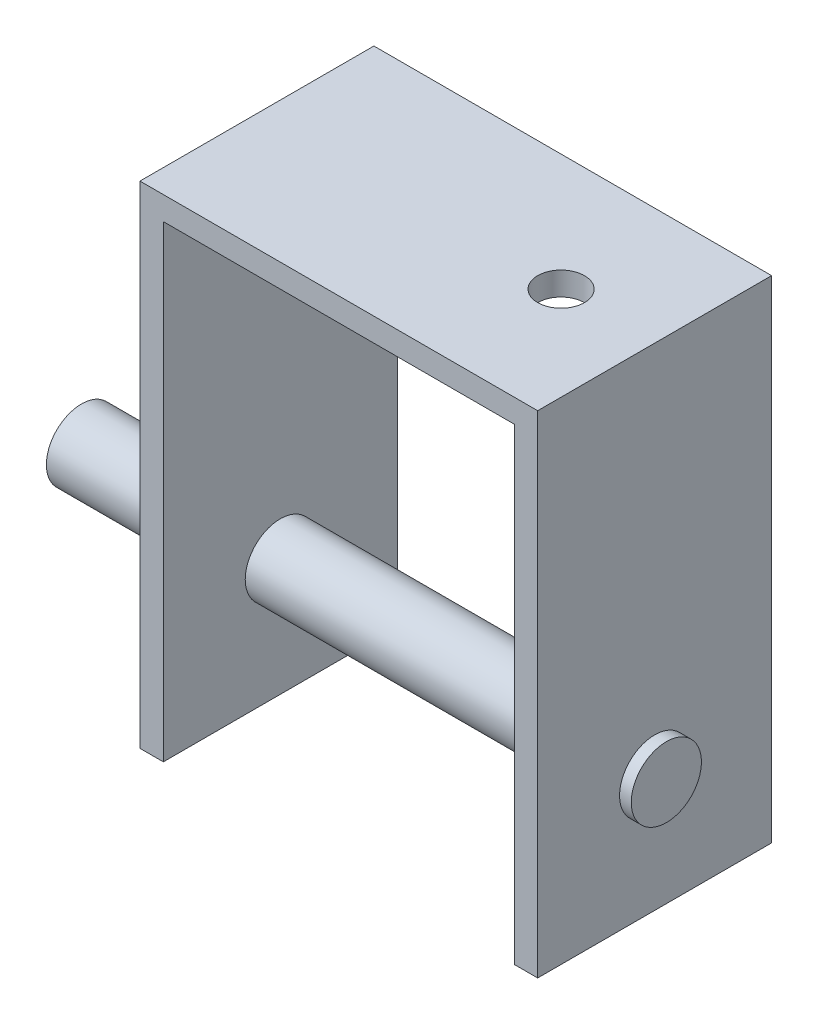
ISO-10303-21;
HEADER;
FILE_DESCRIPTION(('STEP AP214'),'2;1');
FILE_NAME('part.step','',(''),(''),'','','');
FILE_SCHEMA(('AUTOMOTIVE_DESIGN { 1 0 10303 214 1 1 1 1 }'));
ENDSEC;
DATA;
#1=APPLICATION_CONTEXT('core data for automotive mechanical design processes');
#2=APPLICATION_PROTOCOL_DEFINITION('international standard','automotive_design',2000,#1);
#3=PRODUCT_CONTEXT('',#1,'mechanical');
#4=PRODUCT('Part','Part','',(#3));
#5=PRODUCT_RELATED_PRODUCT_CATEGORY('part','',(#4));
#6=PRODUCT_DEFINITION_FORMATION('','',#4);
#7=PRODUCT_DEFINITION_CONTEXT('part definition',#1,'design');
#8=PRODUCT_DEFINITION('design','',#6,#7);
#9=PRODUCT_DEFINITION_SHAPE('','',#8);
#10=(LENGTH_UNIT() NAMED_UNIT(*) SI_UNIT(.MILLI.,.METRE.));
#11=(NAMED_UNIT(*) PLANE_ANGLE_UNIT() SI_UNIT($,.RADIAN.));
#12=(NAMED_UNIT(*) SI_UNIT($,.STERADIAN.) SOLID_ANGLE_UNIT());
#13=UNCERTAINTY_MEASURE_WITH_UNIT(LENGTH_MEASURE(1.E-05),#10,'distance_accuracy_value','');
#14=(GEOMETRIC_REPRESENTATION_CONTEXT(3) GLOBAL_UNCERTAINTY_ASSIGNED_CONTEXT((#13)) GLOBAL_UNIT_ASSIGNED_CONTEXT((#10,
#11,#12)) REPRESENTATION_CONTEXT('',''));
#15=CARTESIAN_POINT('',(0.,0.,0.));
#16=DIRECTION('',(0.,0.,1.));
#17=DIRECTION('',(1.,0.,0.));
#18=AXIS2_PLACEMENT_3D('',#15,#16,#17);
#19=CARTESIAN_POINT('',(-38.9636651003149,28.8453586159442,20.));
#20=DIRECTION('',(1.,0.,0.));
#21=DIRECTION('',(0.,1.,0.));
#22=AXIS2_PLACEMENT_3D('',#19,#20,#21);
#23=PLANE('',#22);
#24=CARTESIAN_POINT('',(-38.9636651003148,-1.15464138405578,10.));
#25=DIRECTION('',(1.,0.,0.));
#26=DIRECTION('',(0.,1.,0.));
#27=AXIS2_PLACEMENT_3D('',#24,#25,#26);
#28=CIRCLE('',#27,3.);
#29=CARTESIAN_POINT('',(-38.9636651003148,1.84535861594422,10.));
#30=VERTEX_POINT('',#29);
#31=EDGE_CURVE('E146',#30,#30,#28,.T.);
#32=ORIENTED_EDGE('',*,*,#31,.T.);
#33=EDGE_LOOP('',(#32));
#34=FACE_BOUND('',#33,.T.);
#35=DIRECTION('',(0.,-1.,0.));
#36=VECTOR('',#35,1.);
#37=CARTESIAN_POINT('',(-38.9636651003149,28.8453586159442,0.));
#38=LINE('',#37,#36);
#39=CARTESIAN_POINT('',(-38.9636651003149,30.8453586159442,0.));
#40=VERTEX_POINT('',#39);
#41=CARTESIAN_POINT('',(-38.9636651003148,-11.1546413840558,0.));
#42=VERTEX_POINT('',#41);
#43=EDGE_CURVE('E100',#40,#42,#38,.T.);
#44=ORIENTED_EDGE('',*,*,#43,.T.);
#45=DIRECTION('',(0.,0.,-1.));
#46=VECTOR('',#45,1.);
#47=CARTESIAN_POINT('',(-38.9636651003148,-11.1546413840558,20.));
#48=LINE('',#47,#46);
#49=CARTESIAN_POINT('',(-38.9636651003148,-11.1546413840558,20.));
#50=VERTEX_POINT('',#49);
#51=EDGE_CURVE('E13',#50,#42,#48,.T.);
#52=ORIENTED_EDGE('',*,*,#51,.F.);
#53=DIRECTION('',(0.,-1.,0.));
#54=VECTOR('',#53,1.);
#55=CARTESIAN_POINT('',(-38.9636651003149,30.8453586159442,20.));
#56=LINE('',#55,#54);
#57=CARTESIAN_POINT('',(-38.9636651003149,30.8453586159442,20.));
#58=VERTEX_POINT('',#57);
#59=EDGE_CURVE('E106',#58,#50,#56,.T.);
#60=ORIENTED_EDGE('',*,*,#59,.F.);
#61=DIRECTION('',(0.,0.,-1.));
#62=VECTOR('',#61,1.);
#63=CARTESIAN_POINT('',(-38.9636651003149,30.8453586159442,20.));
#64=LINE('',#63,#62);
#65=EDGE_CURVE('E140',#58,#40,#64,.T.);
#66=ORIENTED_EDGE('',*,*,#65,.T.);
#67=EDGE_LOOP('',(#44,#52,#60,#66));
#68=FACE_BOUND('',#67,.T.);
#69=ADVANCED_FACE('F47',(#34,#68),#23,.F.);
#70=CARTESIAN_POINT('',(-38.9636651003148,-11.1546413840558,20.));
#71=DIRECTION('',(0.,1.,0.));
#72=DIRECTION('',(0.,0.,1.));
#73=AXIS2_PLACEMENT_3D('',#70,#71,#72);
#74=PLANE('',#73);
#75=DIRECTION('',(1.,0.,0.));
#76=VECTOR('',#75,1.);
#77=CARTESIAN_POINT('',(-38.9636651003148,-11.1546413840558,0.));
#78=LINE('',#77,#76);
#79=CARTESIAN_POINT('',(-36.9636651003148,-11.1546413840558,0.));
#80=VERTEX_POINT('',#79);
#81=EDGE_CURVE('E145',#42,#80,#78,.T.);
#82=ORIENTED_EDGE('',*,*,#81,.T.);
#83=DIRECTION('',(0.,0.,-1.));
#84=VECTOR('',#83,1.);
#85=CARTESIAN_POINT('',(-36.9636651003148,-11.1546413840558,20.));
#86=LINE('',#85,#84);
#87=CARTESIAN_POINT('',(-36.9636651003148,-11.1546413840558,20.));
#88=VERTEX_POINT('',#87);
#89=EDGE_CURVE('E56',#88,#80,#86,.T.);
#90=ORIENTED_EDGE('',*,*,#89,.F.);
#91=DIRECTION('',(1.,0.,0.));
#92=VECTOR('',#91,1.);
#93=CARTESIAN_POINT('',(-38.9636651003148,-11.1546413840558,20.));
#94=LINE('',#93,#92);
#95=EDGE_CURVE('E191',#50,#88,#94,.T.);
#96=ORIENTED_EDGE('',*,*,#95,.F.);
#97=ORIENTED_EDGE('',*,*,#51,.T.);
#98=EDGE_LOOP('',(#82,#90,#96,#97));
#99=FACE_BOUND('',#98,.T.);
#100=ADVANCED_FACE('F228',(#99),#74,.F.);
#101=CARTESIAN_POINT('',(-36.9636651003148,-11.1546413840558,20.));
#102=DIRECTION('',(-1.,0.,0.));
#103=DIRECTION('',(0.,0.,1.));
#104=AXIS2_PLACEMENT_3D('',#101,#102,#103);
#105=PLANE('',#104);
#106=CARTESIAN_POINT('',(-36.9636651003148,-1.15464138405578,10.));
#107=DIRECTION('',(-1.,0.,0.));
#108=DIRECTION('',(0.,0.,1.));
#109=AXIS2_PLACEMENT_3D('',#106,#107,#108);
#110=CIRCLE('',#109,3.);
#111=CARTESIAN_POINT('',(-36.9636651003148,-1.15464138405578,13.));
#112=VERTEX_POINT('',#111);
#113=EDGE_CURVE('E196',#112,#112,#110,.T.);
#114=ORIENTED_EDGE('',*,*,#113,.T.);
#115=EDGE_LOOP('',(#114));
#116=FACE_BOUND('',#115,.T.);
#117=DIRECTION('',(0.,1.,0.));
#118=VECTOR('',#117,1.);
#119=CARTESIAN_POINT('',(-36.9636651003148,-11.1546413840558,0.));
#120=LINE('',#119,#118);
#121=CARTESIAN_POINT('',(-36.9636651003148,28.8453586159442,0.));
#122=VERTEX_POINT('',#121);
#123=EDGE_CURVE('E148',#80,#122,#120,.T.);
#124=ORIENTED_EDGE('',*,*,#123,.T.);
#125=DIRECTION('',(0.,0.,-1.));
#126=VECTOR('',#125,1.);
#127=CARTESIAN_POINT('',(-36.9636651003148,28.8453586159442,20.));
#128=LINE('',#127,#126);
#129=CARTESIAN_POINT('',(-36.9636651003148,28.8453586159442,20.));
#130=VERTEX_POINT('',#129);
#131=EDGE_CURVE('E165',#130,#122,#128,.T.);
#132=ORIENTED_EDGE('',*,*,#131,.F.);
#133=DIRECTION('',(0.,1.,0.));
#134=VECTOR('',#133,1.);
#135=CARTESIAN_POINT('',(-36.9636651003148,-11.1546413840558,20.));
#136=LINE('',#135,#134);
#137=EDGE_CURVE('E175',#88,#130,#136,.T.);
#138=ORIENTED_EDGE('',*,*,#137,.F.);
#139=ORIENTED_EDGE('',*,*,#89,.T.);
#140=EDGE_LOOP('',(#124,#132,#138,#139));
#141=FACE_BOUND('',#140,.T.);
#142=ADVANCED_FACE('F173',(#116,#141),#105,.F.);
#143=CARTESIAN_POINT('',(-36.9636651003148,28.8453586159442,20.));
#144=DIRECTION('',(0.,1.,0.));
#145=DIRECTION('',(0.,0.,1.));
#146=AXIS2_PLACEMENT_3D('',#143,#144,#145);
#147=PLANE('',#146);
#148=CARTESIAN_POINT('',(-12.9636651003149,28.8453586159442,10.));
#149=DIRECTION('',(0.,1.,0.));
#150=DIRECTION('',(0.,0.,1.));
#151=AXIS2_PLACEMENT_3D('',#148,#149,#150);
#152=CIRCLE('',#151,2.);
#153=CARTESIAN_POINT('',(-12.9636651003149,28.8453586159442,12.));
#154=VERTEX_POINT('',#153);
#155=EDGE_CURVE('E208',#154,#154,#152,.T.);
#156=ORIENTED_EDGE('',*,*,#155,.T.);
#157=EDGE_LOOP('',(#156));
#158=FACE_BOUND('',#157,.T.);
#159=DIRECTION('',(1.,0.,0.));
#160=VECTOR('',#159,1.);
#161=CARTESIAN_POINT('',(-36.9636651003148,28.8453586159442,0.));
#162=LINE('',#161,#160);
#163=CARTESIAN_POINT('',(-6.96366510031485,28.8453586159442,0.));
#164=VERTEX_POINT('',#163);
#165=EDGE_CURVE('E150',#122,#164,#162,.T.);
#166=ORIENTED_EDGE('',*,*,#165,.T.);
#167=DIRECTION('',(0.,0.,-1.));
#168=VECTOR('',#167,1.);
#169=CARTESIAN_POINT('',(-6.96366510031485,28.8453586159442,20.));
#170=LINE('',#169,#168);
#171=CARTESIAN_POINT('',(-6.96366510031485,28.8453586159442,20.));
#172=VERTEX_POINT('',#171);
#173=EDGE_CURVE('E162',#172,#164,#170,.T.);
#174=ORIENTED_EDGE('',*,*,#173,.F.);
#175=DIRECTION('',(1.,0.,0.));
#176=VECTOR('',#175,1.);
#177=CARTESIAN_POINT('',(-36.9636651003148,28.8453586159442,20.));
#178=LINE('',#177,#176);
#179=EDGE_CURVE('E187',#130,#172,#178,.T.);
#180=ORIENTED_EDGE('',*,*,#179,.F.);
#181=ORIENTED_EDGE('',*,*,#131,.T.);
#182=EDGE_LOOP('',(#166,#174,#180,#181));
#183=FACE_BOUND('',#182,.T.);
#184=ADVANCED_FACE('F183',(#158,#183),#147,.F.);
#185=CARTESIAN_POINT('',(-6.96366510031485,28.8453586159442,20.));
#186=DIRECTION('',(1.,0.,0.));
#187=DIRECTION('',(0.,1.,0.));
#188=AXIS2_PLACEMENT_3D('',#185,#186,#187);
#189=PLANE('',#188);
#190=CARTESIAN_POINT('',(-6.96366510031484,-1.15464138405578,10.));
#191=DIRECTION('',(1.,0.,0.));
#192=DIRECTION('',(0.,1.,0.));
#193=AXIS2_PLACEMENT_3D('',#190,#191,#192);
#194=CIRCLE('',#193,3.);
#195=CARTESIAN_POINT('',(-6.96366510031484,1.84535861594422,10.));
#196=VERTEX_POINT('',#195);
#197=EDGE_CURVE('E199',#196,#196,#194,.T.);
#198=ORIENTED_EDGE('',*,*,#197,.T.);
#199=EDGE_LOOP('',(#198));
#200=FACE_BOUND('',#199,.T.);
#201=DIRECTION('',(0.,-1.,0.));
#202=VECTOR('',#201,1.);
#203=CARTESIAN_POINT('',(-6.96366510031485,28.8453586159442,0.));
#204=LINE('',#203,#202);
#205=CARTESIAN_POINT('',(-6.96366510031484,-11.1546413840558,0.));
#206=VERTEX_POINT('',#205);
#207=EDGE_CURVE('E152',#164,#206,#204,.T.);
#208=ORIENTED_EDGE('',*,*,#207,.T.);
#209=DIRECTION('',(0.,0.,-1.));
#210=VECTOR('',#209,1.);
#211=CARTESIAN_POINT('',(-6.96366510031484,-11.1546413840558,20.));
#212=LINE('',#211,#210);
#213=CARTESIAN_POINT('',(-6.96366510031484,-11.1546413840558,20.));
#214=VERTEX_POINT('',#213);
#215=EDGE_CURVE('E135',#214,#206,#212,.T.);
#216=ORIENTED_EDGE('',*,*,#215,.F.);
#217=DIRECTION('',(0.,-1.,0.));
#218=VECTOR('',#217,1.);
#219=CARTESIAN_POINT('',(-6.96366510031485,28.8453586159442,20.));
#220=LINE('',#219,#218);
#221=EDGE_CURVE('E126',#172,#214,#220,.T.);
#222=ORIENTED_EDGE('',*,*,#221,.F.);
#223=ORIENTED_EDGE('',*,*,#173,.T.);
#224=EDGE_LOOP('',(#208,#216,#222,#223));
#225=FACE_BOUND('',#224,.T.);
#226=ADVANCED_FACE('F186',(#200,#225),#189,.F.);
#227=CARTESIAN_POINT('',(-6.96366510031484,-11.1546413840558,20.));
#228=DIRECTION('',(0.,1.,0.));
#229=DIRECTION('',(0.,0.,1.));
#230=AXIS2_PLACEMENT_3D('',#227,#228,#229);
#231=PLANE('',#230);
#232=DIRECTION('',(1.,0.,0.));
#233=VECTOR('',#232,1.);
#234=CARTESIAN_POINT('',(-6.96366510031484,-11.1546413840558,0.));
#235=LINE('',#234,#233);
#236=CARTESIAN_POINT('',(-4.96366510031484,-11.1546413840558,0.));
#237=VERTEX_POINT('',#236);
#238=EDGE_CURVE('E134',#206,#237,#235,.T.);
#239=ORIENTED_EDGE('',*,*,#238,.T.);
#240=DIRECTION('',(0.,0.,-1.));
#241=VECTOR('',#240,1.);
#242=CARTESIAN_POINT('',(-4.96366510031484,-11.1546413840558,20.));
#243=LINE('',#242,#241);
#244=CARTESIAN_POINT('',(-4.96366510031484,-11.1546413840558,20.));
#245=VERTEX_POINT('',#244);
#246=EDGE_CURVE('E131',#245,#237,#243,.T.);
#247=ORIENTED_EDGE('',*,*,#246,.F.);
#248=DIRECTION('',(1.,0.,0.));
#249=VECTOR('',#248,1.);
#250=CARTESIAN_POINT('',(-6.96366510031484,-11.1546413840558,20.));
#251=LINE('',#250,#249);
#252=EDGE_CURVE('E120',#214,#245,#251,.T.);
#253=ORIENTED_EDGE('',*,*,#252,.F.);
#254=ORIENTED_EDGE('',*,*,#215,.T.);
#255=EDGE_LOOP('',(#239,#247,#253,#254));
#256=FACE_BOUND('',#255,.T.);
#257=ADVANCED_FACE('F132',(#256),#231,.F.);
#258=CARTESIAN_POINT('',(-4.96366510031484,-11.1546413840558,20.));
#259=DIRECTION('',(-1.,0.,0.));
#260=DIRECTION('',(0.,-1.,0.));
#261=AXIS2_PLACEMENT_3D('',#258,#259,#260);
#262=PLANE('',#261);
#263=CARTESIAN_POINT('',(-4.96366510031484,-1.15464138405578,10.));
#264=DIRECTION('',(-1.,0.,0.));
#265=DIRECTION('',(0.,-1.,0.));
#266=AXIS2_PLACEMENT_3D('',#263,#264,#265);
#267=CIRCLE('',#266,3.);
#268=CARTESIAN_POINT('',(-4.96366510031484,-4.15464138405578,10.));
#269=VERTEX_POINT('',#268);
#270=EDGE_CURVE('E50',#269,#269,#267,.T.);
#271=ORIENTED_EDGE('',*,*,#270,.T.);
#272=EDGE_LOOP('',(#271));
#273=FACE_BOUND('',#272,.T.);
#274=DIRECTION('',(0.,1.,0.));
#275=VECTOR('',#274,1.);
#276=CARTESIAN_POINT('',(-4.96366510031484,-11.1546413840558,0.));
#277=LINE('',#276,#275);
#278=CARTESIAN_POINT('',(-4.96366510031484,30.8453586159442,0.));
#279=VERTEX_POINT('',#278);
#280=EDGE_CURVE('E93',#237,#279,#277,.T.);
#281=ORIENTED_EDGE('',*,*,#280,.T.);
#282=DIRECTION('',(0.,0.,-1.));
#283=VECTOR('',#282,1.);
#284=CARTESIAN_POINT('',(-4.96366510031484,30.8453586159442,20.));
#285=LINE('',#284,#283);
#286=CARTESIAN_POINT('',(-4.96366510031484,30.8453586159442,20.));
#287=VERTEX_POINT('',#286);
#288=EDGE_CURVE('E136',#287,#279,#285,.T.);
#289=ORIENTED_EDGE('',*,*,#288,.F.);
#290=DIRECTION('',(0.,1.,0.));
#291=VECTOR('',#290,1.);
#292=CARTESIAN_POINT('',(-4.96366510031484,-11.1546413840558,20.));
#293=LINE('',#292,#291);
#294=EDGE_CURVE('E124',#245,#287,#293,.T.);
#295=ORIENTED_EDGE('',*,*,#294,.F.);
#296=ORIENTED_EDGE('',*,*,#246,.T.);
#297=EDGE_LOOP('',(#281,#289,#295,#296));
#298=FACE_BOUND('',#297,.T.);
#299=ADVANCED_FACE('F138',(#273,#298),#262,.F.);
#300=CARTESIAN_POINT('',(-4.96366510031484,30.8453586159442,20.));
#301=DIRECTION('',(0.,-1.,0.));
#302=DIRECTION('',(1.,0.,0.));
#303=AXIS2_PLACEMENT_3D('',#300,#301,#302);
#304=PLANE('',#303);
#305=CARTESIAN_POINT('',(-12.9636651003149,30.8453586159442,10.));
#306=DIRECTION('',(0.,1.,0.));
#307=DIRECTION('',(0.,0.,1.));
#308=AXIS2_PLACEMENT_3D('',#305,#306,#307);
#309=CIRCLE('',#308,2.);
#310=CARTESIAN_POINT('',(-12.9636651003149,30.8453586159442,12.));
#311=VERTEX_POINT('',#310);
#312=EDGE_CURVE('E209',#311,#311,#309,.T.);
#313=ORIENTED_EDGE('',*,*,#312,.F.);
#314=EDGE_LOOP('',(#313));
#315=FACE_BOUND('',#314,.T.);
#316=DIRECTION('',(-1.,0.,0.));
#317=VECTOR('',#316,1.);
#318=CARTESIAN_POINT('',(-4.96366510031484,30.8453586159442,0.));
#319=LINE('',#318,#317);
#320=EDGE_CURVE('E156',#279,#40,#319,.T.);
#321=ORIENTED_EDGE('',*,*,#320,.T.);
#322=ORIENTED_EDGE('',*,*,#65,.F.);
#323=DIRECTION('',(-1.,0.,0.));
#324=VECTOR('',#323,1.);
#325=CARTESIAN_POINT('',(-4.96366510031484,30.8453586159442,20.));
#326=LINE('',#325,#324);
#327=EDGE_CURVE('E64',#287,#58,#326,.T.);
#328=ORIENTED_EDGE('',*,*,#327,.F.);
#329=ORIENTED_EDGE('',*,*,#288,.T.);
#330=EDGE_LOOP('',(#321,#322,#328,#329));
#331=FACE_BOUND('',#330,.T.);
#332=ADVANCED_FACE('F223',(#315,#331),#304,.F.);
#333=CARTESIAN_POINT('',(0.,0.,20.));
#334=DIRECTION('',(0.,0.,1.));
#335=DIRECTION('',(1.,0.,0.));
#336=AXIS2_PLACEMENT_3D('',#333,#334,#335);
#337=PLANE('',#336);
#338=ORIENTED_EDGE('',*,*,#59,.T.);
#339=ORIENTED_EDGE('',*,*,#95,.T.);
#340=ORIENTED_EDGE('',*,*,#137,.T.);
#341=ORIENTED_EDGE('',*,*,#179,.T.);
#342=ORIENTED_EDGE('',*,*,#221,.T.);
#343=ORIENTED_EDGE('',*,*,#252,.T.);
#344=ORIENTED_EDGE('',*,*,#294,.T.);
#345=ORIENTED_EDGE('',*,*,#327,.T.);
#346=EDGE_LOOP('',(#338,#339,#340,#341,#342,#343,#344,#345));
#347=FACE_BOUND('',#346,.T.);
#348=ADVANCED_FACE('F122',(#347),#337,.T.);
#349=CARTESIAN_POINT('',(0.,0.,0.));
#350=DIRECTION('',(0.,0.,1.));
#351=DIRECTION('',(1.,0.,0.));
#352=AXIS2_PLACEMENT_3D('',#349,#350,#351);
#353=PLANE('',#352);
#354=ORIENTED_EDGE('',*,*,#43,.F.);
#355=ORIENTED_EDGE('',*,*,#320,.F.);
#356=ORIENTED_EDGE('',*,*,#280,.F.);
#357=ORIENTED_EDGE('',*,*,#238,.F.);
#358=ORIENTED_EDGE('',*,*,#207,.F.);
#359=ORIENTED_EDGE('',*,*,#165,.F.);
#360=ORIENTED_EDGE('',*,*,#123,.F.);
#361=ORIENTED_EDGE('',*,*,#81,.F.);
#362=EDGE_LOOP('',(#354,#355,#356,#357,#358,#359,#360,#361));
#363=FACE_BOUND('',#362,.T.);
#364=ADVANCED_FACE('F179',(#363),#353,.F.);
#365=CARTESIAN_POINT('',(-3.96366510031485,-1.15464138405578,10.));
#366=DIRECTION('',(-1.,0.,0.));
#367=DIRECTION('',(0.,0.,1.));
#368=AXIS2_PLACEMENT_3D('',#365,#366,#367);
#369=PLANE('',#368);
#370=CARTESIAN_POINT('',(-3.96366510031485,-1.15464138405578,10.));
#371=DIRECTION('',(-1.,0.,0.));
#372=DIRECTION('',(0.,0.,1.));
#373=AXIS2_PLACEMENT_3D('',#370,#371,#372);
#374=CIRCLE('',#373,3.);
#375=CARTESIAN_POINT('',(-3.96366510031485,-1.15464138405578,13.));
#376=VERTEX_POINT('',#375);
#377=EDGE_CURVE('E202',#376,#376,#374,.T.);
#378=ORIENTED_EDGE('',*,*,#377,.F.);
#379=EDGE_LOOP('',(#378));
#380=FACE_BOUND('',#379,.T.);
#381=ADVANCED_FACE('F250',(#380),#369,.F.);
#382=CARTESIAN_POINT('',(-3.96366510031485,-1.15464138405578,10.));
#383=DIRECTION('',(-1.,0.,0.));
#384=DIRECTION('',(0.,0.,1.));
#385=AXIS2_PLACEMENT_3D('',#382,#383,#384);
#386=CYLINDRICAL_SURFACE('',#385,3.);
#387=ORIENTED_EDGE('',*,*,#377,.T.);
#388=EDGE_LOOP('',(#387));
#389=FACE_BOUND('',#388,.T.);
#390=ORIENTED_EDGE('',*,*,#270,.F.);
#391=EDGE_LOOP('',(#390));
#392=FACE_BOUND('',#391,.T.);
#393=ADVANCED_FACE('F258',(#389,#392),#386,.T.);
#394=ORIENTED_EDGE('',*,*,#197,.F.);
#395=EDGE_LOOP('',(#394));
#396=FACE_BOUND('',#395,.T.);
#397=ORIENTED_EDGE('',*,*,#113,.F.);
#398=EDGE_LOOP('',(#397));
#399=FACE_BOUND('',#398,.T.);
#400=ADVANCED_FACE('F256',(#396,#399),#386,.T.);
#401=CARTESIAN_POINT('',(-53.9636651003148,-1.15464138405578,10.));
#402=DIRECTION('',(-1.,0.,0.));
#403=DIRECTION('',(0.,0.,1.));
#404=AXIS2_PLACEMENT_3D('',#401,#402,#403);
#405=CIRCLE('',#404,3.);
#406=CARTESIAN_POINT('',(-53.9636651003148,-1.15464138405578,13.));
#407=VERTEX_POINT('',#406);
#408=EDGE_CURVE('E205',#407,#407,#405,.T.);
#409=ORIENTED_EDGE('',*,*,#408,.F.);
#410=EDGE_LOOP('',(#409));
#411=FACE_BOUND('',#410,.T.);
#412=ORIENTED_EDGE('',*,*,#31,.F.);
#413=EDGE_LOOP('',(#412));
#414=FACE_BOUND('',#413,.T.);
#415=ADVANCED_FACE('F253',(#411,#414),#386,.T.);
#416=CARTESIAN_POINT('',(-53.9636651003148,-1.15464138405578,10.));
#417=DIRECTION('',(-1.,0.,0.));
#418=DIRECTION('',(0.,0.,1.));
#419=AXIS2_PLACEMENT_3D('',#416,#417,#418);
#420=PLANE('',#419);
#421=ORIENTED_EDGE('',*,*,#408,.T.);
#422=EDGE_LOOP('',(#421));
#423=FACE_BOUND('',#422,.T.);
#424=ADVANCED_FACE('F219',(#423),#420,.T.);
#425=CARTESIAN_POINT('',(-12.9636651003149,28.8453586159442,10.));
#426=DIRECTION('',(0.,1.,0.));
#427=DIRECTION('',(0.,0.,1.));
#428=AXIS2_PLACEMENT_3D('',#425,#426,#427);
#429=CYLINDRICAL_SURFACE('',#428,2.);
#430=ORIENTED_EDGE('',*,*,#155,.F.);
#431=EDGE_LOOP('',(#430));
#432=FACE_BOUND('',#431,.T.);
#433=ORIENTED_EDGE('',*,*,#312,.T.);
#434=EDGE_LOOP('',(#433));
#435=FACE_BOUND('',#434,.T.);
#436=ADVANCED_FACE('F216',(#432,#435),#429,.F.);
#437=CLOSED_SHELL('',(#69,#100,#142,#184,#226,#257,#299,#332,#348,#364,#381,#393,#400,#415,#424,#436));
#438=MANIFOLD_SOLID_BREP('B2',#437);
#439=ADVANCED_BREP_SHAPE_REPRESENTATION('',(#18,#438),#14);
#440=SHAPE_DEFINITION_REPRESENTATION(#9,#439);
ENDSEC;
END-ISO-10303-21;
